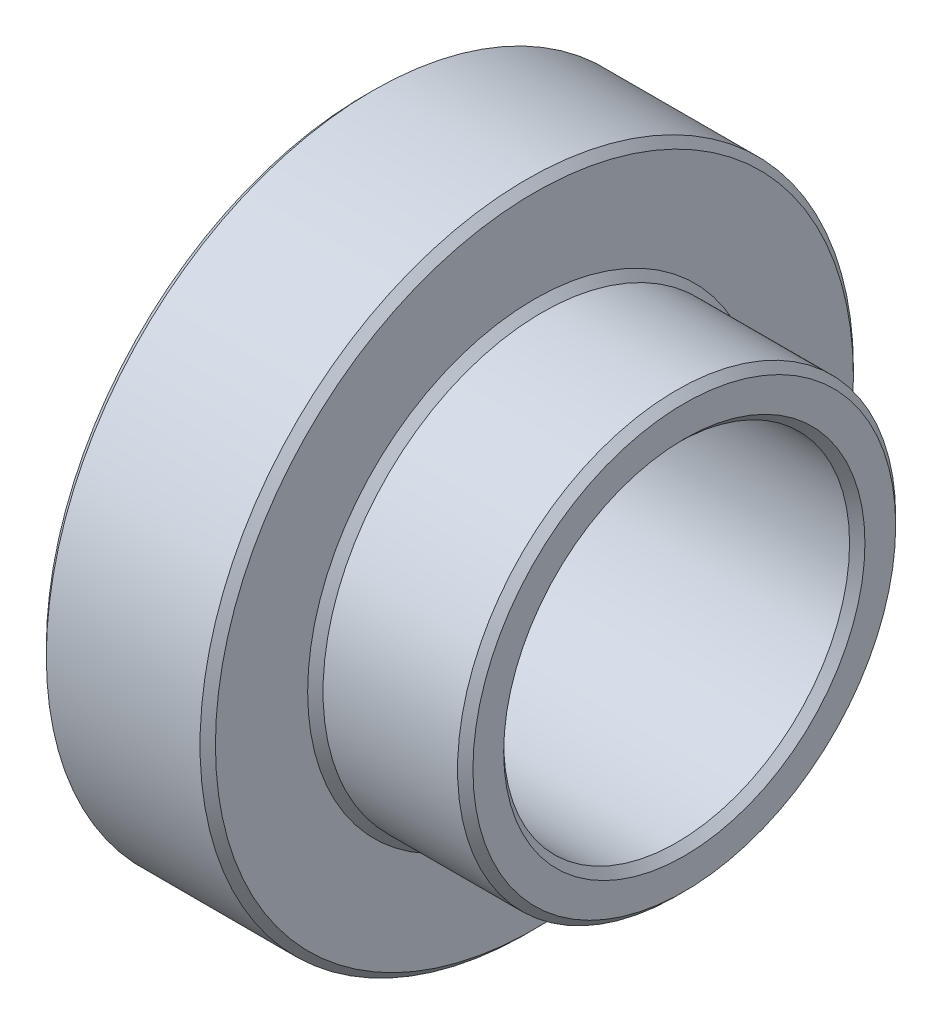
ISO-10303-21;
HEADER;
FILE_DESCRIPTION(('STEP AP214'),'2;1');
FILE_NAME('part.step','',(''),(''),'','','');
FILE_SCHEMA(('AUTOMOTIVE_DESIGN { 1 0 10303 214 1 1 1 1 }'));
ENDSEC;
DATA;
#1=APPLICATION_CONTEXT('core data for automotive mechanical design processes');
#2=APPLICATION_PROTOCOL_DEFINITION('international standard','automotive_design',2000,#1);
#3=PRODUCT_CONTEXT('',#1,'mechanical');
#4=PRODUCT('Part','Part','',(#3));
#5=PRODUCT_RELATED_PRODUCT_CATEGORY('part','',(#4));
#6=PRODUCT_DEFINITION_FORMATION('','',#4);
#7=PRODUCT_DEFINITION_CONTEXT('part definition',#1,'design');
#8=PRODUCT_DEFINITION('design','',#6,#7);
#9=PRODUCT_DEFINITION_SHAPE('','',#8);
#10=(LENGTH_UNIT() NAMED_UNIT(*) SI_UNIT(.MILLI.,.METRE.));
#11=(NAMED_UNIT(*) PLANE_ANGLE_UNIT() SI_UNIT($,.RADIAN.));
#12=(NAMED_UNIT(*) SI_UNIT($,.STERADIAN.) SOLID_ANGLE_UNIT());
#13=UNCERTAINTY_MEASURE_WITH_UNIT(LENGTH_MEASURE(1.E-05),#10,'distance_accuracy_value','');
#14=(GEOMETRIC_REPRESENTATION_CONTEXT(3) GLOBAL_UNCERTAINTY_ASSIGNED_CONTEXT((#13)) GLOBAL_UNIT_ASSIGNED_CONTEXT((#10,
#11,#12)) REPRESENTATION_CONTEXT('',''));
#15=CARTESIAN_POINT('',(0.,0.,0.));
#16=DIRECTION('',(0.,0.,1.));
#17=DIRECTION('',(1.,0.,0.));
#18=AXIS2_PLACEMENT_3D('',#15,#16,#17);
#19=CARTESIAN_POINT('',(43.575,0.,0.));
#20=DIRECTION('',(1.,0.,0.));
#21=DIRECTION('',(0.,0.,-1.));
#22=AXIS2_PLACEMENT_3D('',#19,#20,#21);
#23=CYLINDRICAL_SURFACE('',#22,42.5);
#24=CARTESIAN_POINT('',(1.00000000000001,0.,0.));
#25=DIRECTION('',(-1.,0.,0.));
#26=DIRECTION('',(0.,0.,1.));
#27=AXIS2_PLACEMENT_3D('',#24,#25,#26);
#28=CIRCLE('',#27,42.5);
#29=CARTESIAN_POINT('',(1.00000000000001,0.,42.5));
#30=VERTEX_POINT('',#29);
#31=EDGE_CURVE('E10',#30,#30,#28,.F.);
#32=ORIENTED_EDGE('',*,*,#31,.T.);
#33=EDGE_LOOP('',(#32));
#34=FACE_BOUND('',#33,.T.);
#35=CARTESIAN_POINT('',(21.,0.,0.));
#36=DIRECTION('',(1.,0.,0.));
#37=DIRECTION('',(0.,0.,-1.));
#38=AXIS2_PLACEMENT_3D('',#35,#36,#37);
#39=CIRCLE('',#38,42.5);
#40=CARTESIAN_POINT('',(21.,0.,-42.5));
#41=VERTEX_POINT('',#40);
#42=EDGE_CURVE('E41',#41,#41,#39,.F.);
#43=ORIENTED_EDGE('',*,*,#42,.T.);
#44=EDGE_LOOP('',(#43));
#45=FACE_BOUND('',#44,.T.);
#46=ADVANCED_FACE('F33',(#34,#45),#23,.T.);
#47=CARTESIAN_POINT('',(22.,42.5,0.));
#48=DIRECTION('',(1.,0.,0.));
#49=DIRECTION('',(0.,0.,-1.));
#50=AXIS2_PLACEMENT_3D('',#47,#48,#49);
#51=PLANE('',#50);
#52=CARTESIAN_POINT('',(22.,0.,0.));
#53=DIRECTION('',(1.,0.,0.));
#54=DIRECTION('',(0.,0.,-1.));
#55=AXIS2_PLACEMENT_3D('',#52,#53,#54);
#56=CIRCLE('',#55,29.5);
#57=CARTESIAN_POINT('',(22.,0.,-29.5));
#58=VERTEX_POINT('',#57);
#59=EDGE_CURVE('E45',#58,#58,#56,.F.);
#60=ORIENTED_EDGE('',*,*,#59,.T.);
#61=EDGE_LOOP('',(#60));
#62=FACE_BOUND('',#61,.T.);
#63=CARTESIAN_POINT('',(22.,0.,0.));
#64=DIRECTION('',(1.,0.,0.));
#65=DIRECTION('',(0.,0.,-1.));
#66=AXIS2_PLACEMENT_3D('',#63,#64,#65);
#67=CIRCLE('',#66,41.5);
#68=CARTESIAN_POINT('',(22.,0.,-41.5));
#69=VERTEX_POINT('',#68);
#70=EDGE_CURVE('E49',#69,#69,#67,.T.);
#71=ORIENTED_EDGE('',*,*,#70,.T.);
#72=EDGE_LOOP('',(#71));
#73=FACE_BOUND('',#72,.T.);
#74=ADVANCED_FACE('F95',(#62,#73),#51,.T.);
#75=CARTESIAN_POINT('',(43.575,0.,0.));
#76=DIRECTION('',(1.,0.,0.));
#77=DIRECTION('',(0.,0.,-1.));
#78=AXIS2_PLACEMENT_3D('',#75,#76,#77);
#79=CYLINDRICAL_SURFACE('',#78,28.5);
#80=CARTESIAN_POINT('',(40.5,0.,0.));
#81=DIRECTION('',(1.,0.,0.));
#82=DIRECTION('',(0.,0.,-1.));
#83=AXIS2_PLACEMENT_3D('',#80,#81,#82);
#84=CIRCLE('',#83,28.5);
#85=CARTESIAN_POINT('',(40.5,0.,-28.5));
#86=VERTEX_POINT('',#85);
#87=EDGE_CURVE('E54',#86,#86,#84,.F.);
#88=ORIENTED_EDGE('',*,*,#87,.T.);
#89=EDGE_LOOP('',(#88));
#90=FACE_BOUND('',#89,.T.);
#91=CARTESIAN_POINT('',(23.,0.,0.));
#92=DIRECTION('',(1.,0.,0.));
#93=DIRECTION('',(0.,0.,-1.));
#94=AXIS2_PLACEMENT_3D('',#91,#92,#93);
#95=CIRCLE('',#94,28.5);
#96=CARTESIAN_POINT('',(23.,0.,-28.5));
#97=VERTEX_POINT('',#96);
#98=EDGE_CURVE('E57',#97,#97,#95,.T.);
#99=ORIENTED_EDGE('',*,*,#98,.T.);
#100=EDGE_LOOP('',(#99));
#101=FACE_BOUND('',#100,.T.);
#102=ADVANCED_FACE('F100',(#90,#101),#79,.T.);
#103=CARTESIAN_POINT('',(41.5,28.5,0.));
#104=DIRECTION('',(1.,0.,0.));
#105=DIRECTION('',(0.,0.,-1.));
#106=AXIS2_PLACEMENT_3D('',#103,#104,#105);
#107=PLANE('',#106);
#108=CARTESIAN_POINT('',(41.5,0.,0.));
#109=DIRECTION('',(1.,0.,0.));
#110=DIRECTION('',(0.,0.,-1.));
#111=AXIS2_PLACEMENT_3D('',#108,#109,#110);
#112=CIRCLE('',#111,23.5);
#113=CARTESIAN_POINT('',(41.5,0.,-23.5));
#114=VERTEX_POINT('',#113);
#115=EDGE_CURVE('E60',#114,#114,#112,.F.);
#116=ORIENTED_EDGE('',*,*,#115,.T.);
#117=EDGE_LOOP('',(#116));
#118=FACE_BOUND('',#117,.T.);
#119=CARTESIAN_POINT('',(41.5,0.,0.));
#120=DIRECTION('',(1.,0.,0.));
#121=DIRECTION('',(0.,0.,-1.));
#122=AXIS2_PLACEMENT_3D('',#119,#120,#121);
#123=CIRCLE('',#122,27.5);
#124=CARTESIAN_POINT('',(41.5,0.,-27.5));
#125=VERTEX_POINT('',#124);
#126=EDGE_CURVE('E63',#125,#125,#123,.T.);
#127=ORIENTED_EDGE('',*,*,#126,.T.);
#128=EDGE_LOOP('',(#127));
#129=FACE_BOUND('',#128,.T.);
#130=ADVANCED_FACE('F137',(#118,#129),#107,.T.);
#131=CARTESIAN_POINT('',(43.575,0.,0.));
#132=DIRECTION('',(1.,0.,0.));
#133=DIRECTION('',(0.,0.,-1.));
#134=AXIS2_PLACEMENT_3D('',#131,#132,#133);
#135=CYLINDRICAL_SURFACE('',#134,22.5);
#136=CARTESIAN_POINT('',(0.999999999999994,0.,0.));
#137=DIRECTION('',(-1.,0.,0.));
#138=DIRECTION('',(0.,0.,1.));
#139=AXIS2_PLACEMENT_3D('',#136,#137,#138);
#140=CIRCLE('',#139,22.5);
#141=CARTESIAN_POINT('',(0.999999999999994,0.,22.5));
#142=VERTEX_POINT('',#141);
#143=EDGE_CURVE('E66',#142,#142,#140,.T.);
#144=ORIENTED_EDGE('',*,*,#143,.T.);
#145=EDGE_LOOP('',(#144));
#146=FACE_BOUND('',#145,.T.);
#147=CARTESIAN_POINT('',(40.5,0.,0.));
#148=DIRECTION('',(1.,0.,0.));
#149=DIRECTION('',(0.,0.,-1.));
#150=AXIS2_PLACEMENT_3D('',#147,#148,#149);
#151=CIRCLE('',#150,22.5);
#152=CARTESIAN_POINT('',(40.5,0.,-22.5));
#153=VERTEX_POINT('',#152);
#154=EDGE_CURVE('E69',#153,#153,#151,.T.);
#155=ORIENTED_EDGE('',*,*,#154,.T.);
#156=EDGE_LOOP('',(#155));
#157=FACE_BOUND('',#156,.T.);
#158=ADVANCED_FACE('F139',(#146,#157),#135,.F.);
#159=CARTESIAN_POINT('',(0.,22.5,0.));
#160=DIRECTION('',(-1.,0.,0.));
#161=DIRECTION('',(0.,0.,1.));
#162=AXIS2_PLACEMENT_3D('',#159,#160,#161);
#163=PLANE('',#162);
#164=CARTESIAN_POINT('',(0.,0.,0.));
#165=DIRECTION('',(-1.,0.,0.));
#166=DIRECTION('',(0.,0.,1.));
#167=AXIS2_PLACEMENT_3D('',#164,#165,#166);
#168=CIRCLE('',#167,23.5);
#169=CARTESIAN_POINT('',(0.,0.,23.5));
#170=VERTEX_POINT('',#169);
#171=EDGE_CURVE('E72',#170,#170,#168,.F.);
#172=ORIENTED_EDGE('',*,*,#171,.T.);
#173=EDGE_LOOP('',(#172));
#174=FACE_BOUND('',#173,.T.);
#175=CARTESIAN_POINT('',(0.,0.,0.));
#176=DIRECTION('',(-1.,0.,0.));
#177=DIRECTION('',(0.,0.,1.));
#178=AXIS2_PLACEMENT_3D('',#175,#176,#177);
#179=CIRCLE('',#178,41.5);
#180=CARTESIAN_POINT('',(0.,0.,41.5));
#181=VERTEX_POINT('',#180);
#182=EDGE_CURVE('E75',#181,#181,#179,.T.);
#183=ORIENTED_EDGE('',*,*,#182,.T.);
#184=EDGE_LOOP('',(#183));
#185=FACE_BOUND('',#184,.T.);
#186=ADVANCED_FACE('F79',(#174,#185),#163,.T.);
#187=CARTESIAN_POINT('',(0.,0.,0.));
#188=DIRECTION('',(-1.,0.,0.));
#189=DIRECTION('',(0.,0.,1.));
#190=AXIS2_PLACEMENT_3D('',#187,#188,#189);
#191=CONICAL_SURFACE('',#190,23.5,0.785398163397457);
#192=ORIENTED_EDGE('',*,*,#143,.F.);
#193=EDGE_LOOP('',(#192));
#194=FACE_BOUND('',#193,.T.);
#195=ORIENTED_EDGE('',*,*,#171,.F.);
#196=EDGE_LOOP('',(#195));
#197=FACE_BOUND('',#196,.T.);
#198=ADVANCED_FACE('F106',(#194,#197),#191,.F.);
#199=CARTESIAN_POINT('',(40.5,0.,0.));
#200=DIRECTION('',(1.,0.,0.));
#201=DIRECTION('',(0.,0.,-1.));
#202=AXIS2_PLACEMENT_3D('',#199,#200,#201);
#203=CONICAL_SURFACE('',#202,22.5,0.785398163397455);
#204=ORIENTED_EDGE('',*,*,#115,.F.);
#205=EDGE_LOOP('',(#204));
#206=FACE_BOUND('',#205,.T.);
#207=ORIENTED_EDGE('',*,*,#154,.F.);
#208=EDGE_LOOP('',(#207));
#209=FACE_BOUND('',#208,.T.);
#210=ADVANCED_FACE('F112',(#206,#209),#203,.F.);
#211=CARTESIAN_POINT('',(41.5,0.,0.));
#212=DIRECTION('',(-1.,0.,0.));
#213=DIRECTION('',(0.,0.,1.));
#214=AXIS2_PLACEMENT_3D('',#211,#212,#213);
#215=CONICAL_SURFACE('',#214,27.5,0.785398163397447);
#216=ORIENTED_EDGE('',*,*,#87,.F.);
#217=EDGE_LOOP('',(#216));
#218=FACE_BOUND('',#217,.T.);
#219=ORIENTED_EDGE('',*,*,#126,.F.);
#220=EDGE_LOOP('',(#219));
#221=FACE_BOUND('',#220,.T.);
#222=ADVANCED_FACE('F90',(#218,#221),#215,.T.);
#223=CARTESIAN_POINT('',(23.,0.,0.));
#224=DIRECTION('',(-1.,0.,0.));
#225=DIRECTION('',(0.,0.,1.));
#226=AXIS2_PLACEMENT_3D('',#223,#224,#225);
#227=CONICAL_SURFACE('',#226,28.5,0.785398163397441);
#228=ORIENTED_EDGE('',*,*,#59,.F.);
#229=EDGE_LOOP('',(#228));
#230=FACE_BOUND('',#229,.T.);
#231=ORIENTED_EDGE('',*,*,#98,.F.);
#232=EDGE_LOOP('',(#231));
#233=FACE_BOUND('',#232,.T.);
#234=ADVANCED_FACE('F84',(#230,#233),#227,.T.);
#235=CARTESIAN_POINT('',(1.00000000000001,0.,0.));
#236=DIRECTION('',(1.,0.,0.));
#237=DIRECTION('',(0.,0.,-1.));
#238=AXIS2_PLACEMENT_3D('',#235,#236,#237);
#239=CONICAL_SURFACE('',#238,42.5,0.785398163397445);
#240=ORIENTED_EDGE('',*,*,#182,.F.);
#241=EDGE_LOOP('',(#240));
#242=FACE_BOUND('',#241,.T.);
#243=ORIENTED_EDGE('',*,*,#31,.F.);
#244=EDGE_LOOP('',(#243));
#245=FACE_BOUND('',#244,.T.);
#246=ADVANCED_FACE('F81',(#242,#245),#239,.T.);
#247=CARTESIAN_POINT('',(22.,0.,0.));
#248=DIRECTION('',(-1.,0.,0.));
#249=DIRECTION('',(0.,0.,1.));
#250=AXIS2_PLACEMENT_3D('',#247,#248,#249);
#251=CONICAL_SURFACE('',#250,41.5,0.785398163397448);
#252=ORIENTED_EDGE('',*,*,#42,.F.);
#253=EDGE_LOOP('',(#252));
#254=FACE_BOUND('',#253,.T.);
#255=ORIENTED_EDGE('',*,*,#70,.F.);
#256=EDGE_LOOP('',(#255));
#257=FACE_BOUND('',#256,.T.);
#258=ADVANCED_FACE('F36',(#254,#257),#251,.T.);
#259=CLOSED_SHELL('',(#46,#74,#102,#130,#158,#186,#198,#210,#222,#234,#246,#258));
#260=MANIFOLD_SOLID_BREP('B2',#259);
#261=ADVANCED_BREP_SHAPE_REPRESENTATION('',(#18,#260),#14);
#262=SHAPE_DEFINITION_REPRESENTATION(#9,#261);
ENDSEC;
END-ISO-10303-21;
